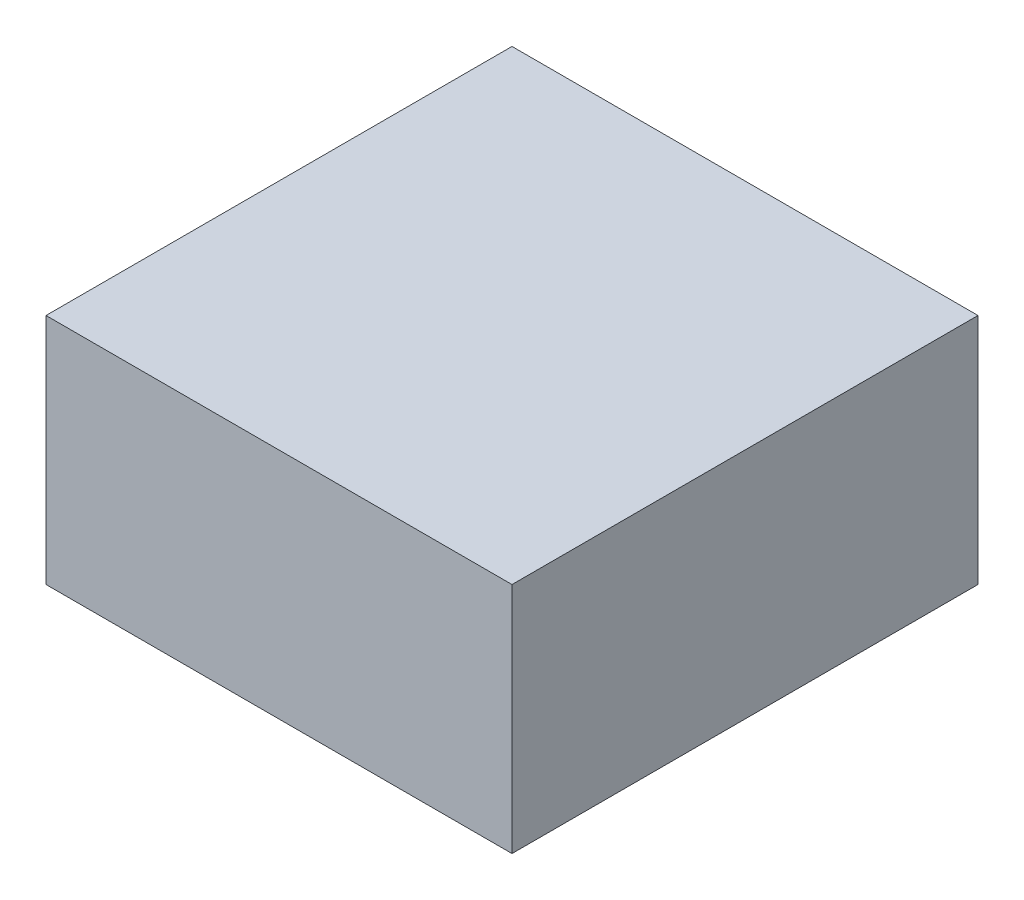
ISO-10303-21;
HEADER;
FILE_DESCRIPTION(('STEP AP214'),'2;1');
FILE_NAME('part.step','',(''),(''),'','','');
FILE_SCHEMA(('AUTOMOTIVE_DESIGN { 1 0 10303 214 1 1 1 1 }'));
ENDSEC;
DATA;
#1=APPLICATION_CONTEXT('core data for automotive mechanical design processes');
#2=APPLICATION_PROTOCOL_DEFINITION('international standard','automotive_design',2000,#1);
#3=PRODUCT_CONTEXT('',#1,'mechanical');
#4=PRODUCT('Part','Part','',(#3));
#5=PRODUCT_RELATED_PRODUCT_CATEGORY('part','',(#4));
#6=PRODUCT_DEFINITION_FORMATION('','',#4);
#7=PRODUCT_DEFINITION_CONTEXT('part definition',#1,'design');
#8=PRODUCT_DEFINITION('design','',#6,#7);
#9=PRODUCT_DEFINITION_SHAPE('','',#8);
#10=(LENGTH_UNIT() NAMED_UNIT(*) SI_UNIT(.MILLI.,.METRE.));
#11=(NAMED_UNIT(*) PLANE_ANGLE_UNIT() SI_UNIT($,.RADIAN.));
#12=(NAMED_UNIT(*) SI_UNIT($,.STERADIAN.) SOLID_ANGLE_UNIT());
#13=UNCERTAINTY_MEASURE_WITH_UNIT(LENGTH_MEASURE(1.E-05),#10,'distance_accuracy_value','');
#14=(GEOMETRIC_REPRESENTATION_CONTEXT(3) GLOBAL_UNCERTAINTY_ASSIGNED_CONTEXT((#13)) GLOBAL_UNIT_ASSIGNED_CONTEXT((#10,
#11,#12)) REPRESENTATION_CONTEXT('',''));
#15=CARTESIAN_POINT('',(0.,0.,0.));
#16=DIRECTION('',(0.,0.,1.));
#17=DIRECTION('',(1.,0.,0.));
#18=AXIS2_PLACEMENT_3D('',#15,#16,#17);
#19=CARTESIAN_POINT('',(25.,25.,25.));
#20=DIRECTION('',(-1.,0.,0.));
#21=DIRECTION('',(0.,0.,1.));
#22=AXIS2_PLACEMENT_3D('',#19,#20,#21);
#23=PLANE('',#22);
#24=DIRECTION('',(0.,0.,-1.));
#25=VECTOR('',#24,1.);
#26=CARTESIAN_POINT('',(25.,0.,25.));
#27=LINE('',#26,#25);
#28=CARTESIAN_POINT('',(25.,0.,25.));
#29=VERTEX_POINT('',#28);
#30=CARTESIAN_POINT('',(25.,0.,-25.));
#31=VERTEX_POINT('',#30);
#32=EDGE_CURVE('E98',#29,#31,#27,.T.);
#33=ORIENTED_EDGE('',*,*,#32,.T.);
#34=DIRECTION('',(0.,-1.,0.));
#35=VECTOR('',#34,1.);
#36=CARTESIAN_POINT('',(25.,25.,-25.));
#37=LINE('',#36,#35);
#38=CARTESIAN_POINT('',(25.,25.,-25.));
#39=VERTEX_POINT('',#38);
#40=EDGE_CURVE('E11',#39,#31,#37,.T.);
#41=ORIENTED_EDGE('',*,*,#40,.F.);
#42=DIRECTION('',(0.,0.,-1.));
#43=VECTOR('',#42,1.);
#44=CARTESIAN_POINT('',(25.,25.,25.));
#45=LINE('',#44,#43);
#46=CARTESIAN_POINT('',(25.,25.,25.));
#47=VERTEX_POINT('',#46);
#48=EDGE_CURVE('E86',#47,#39,#45,.T.);
#49=ORIENTED_EDGE('',*,*,#48,.F.);
#50=DIRECTION('',(0.,-1.,0.));
#51=VECTOR('',#50,1.);
#52=CARTESIAN_POINT('',(25.,25.,25.));
#53=LINE('',#52,#51);
#54=EDGE_CURVE('E94',#47,#29,#53,.T.);
#55=ORIENTED_EDGE('',*,*,#54,.T.);
#56=EDGE_LOOP('',(#33,#41,#49,#55));
#57=FACE_BOUND('',#56,.T.);
#58=ADVANCED_FACE('F35',(#57),#23,.F.);
#59=CARTESIAN_POINT('',(-25.,25.,-25.));
#60=DIRECTION('',(0.,0.,1.));
#61=DIRECTION('',(1.,0.,0.));
#62=AXIS2_PLACEMENT_3D('',#59,#60,#61);
#63=PLANE('',#62);
#64=DIRECTION('',(-1.,0.,0.));
#65=VECTOR('',#64,1.);
#66=CARTESIAN_POINT('',(-25.,0.,-25.));
#67=LINE('',#66,#65);
#68=CARTESIAN_POINT('',(-25.,0.,-25.));
#69=VERTEX_POINT('',#68);
#70=EDGE_CURVE('E90',#31,#69,#67,.T.);
#71=ORIENTED_EDGE('',*,*,#70,.T.);
#72=DIRECTION('',(0.,-1.,0.));
#73=VECTOR('',#72,1.);
#74=CARTESIAN_POINT('',(-25.,25.,-25.));
#75=LINE('',#74,#73);
#76=CARTESIAN_POINT('',(-25.,25.,-25.));
#77=VERTEX_POINT('',#76);
#78=EDGE_CURVE('E43',#77,#69,#75,.T.);
#79=ORIENTED_EDGE('',*,*,#78,.F.);
#80=DIRECTION('',(-1.,0.,0.));
#81=VECTOR('',#80,1.);
#82=CARTESIAN_POINT('',(-25.,25.,-25.));
#83=LINE('',#82,#81);
#84=EDGE_CURVE('E81',#39,#77,#83,.T.);
#85=ORIENTED_EDGE('',*,*,#84,.F.);
#86=ORIENTED_EDGE('',*,*,#40,.T.);
#87=EDGE_LOOP('',(#71,#79,#85,#86));
#88=FACE_BOUND('',#87,.T.);
#89=ADVANCED_FACE('F89',(#88),#63,.F.);
#90=CARTESIAN_POINT('',(-25.,25.,25.));
#91=DIRECTION('',(1.,0.,0.));
#92=DIRECTION('',(0.,0.,-1.));
#93=AXIS2_PLACEMENT_3D('',#90,#91,#92);
#94=PLANE('',#93);
#95=DIRECTION('',(0.,0.,1.));
#96=VECTOR('',#95,1.);
#97=CARTESIAN_POINT('',(-25.,0.,25.));
#98=LINE('',#97,#96);
#99=CARTESIAN_POINT('',(-25.,0.,25.));
#100=VERTEX_POINT('',#99);
#101=EDGE_CURVE('E68',#69,#100,#98,.T.);
#102=ORIENTED_EDGE('',*,*,#101,.T.);
#103=DIRECTION('',(0.,-1.,0.));
#104=VECTOR('',#103,1.);
#105=CARTESIAN_POINT('',(-25.,25.,25.));
#106=LINE('',#105,#104);
#107=CARTESIAN_POINT('',(-25.,25.,25.));
#108=VERTEX_POINT('',#107);
#109=EDGE_CURVE('E91',#108,#100,#106,.T.);
#110=ORIENTED_EDGE('',*,*,#109,.F.);
#111=DIRECTION('',(0.,0.,1.));
#112=VECTOR('',#111,1.);
#113=CARTESIAN_POINT('',(-25.,25.,25.));
#114=LINE('',#113,#112);
#115=EDGE_CURVE('E84',#77,#108,#114,.T.);
#116=ORIENTED_EDGE('',*,*,#115,.F.);
#117=ORIENTED_EDGE('',*,*,#78,.T.);
#118=EDGE_LOOP('',(#102,#110,#116,#117));
#119=FACE_BOUND('',#118,.T.);
#120=ADVANCED_FACE('F92',(#119),#94,.F.);
#121=CARTESIAN_POINT('',(-25.,25.,25.));
#122=DIRECTION('',(0.,0.,-1.));
#123=DIRECTION('',(-1.,0.,0.));
#124=AXIS2_PLACEMENT_3D('',#121,#122,#123);
#125=PLANE('',#124);
#126=DIRECTION('',(1.,0.,0.));
#127=VECTOR('',#126,1.);
#128=CARTESIAN_POINT('',(-25.,0.,25.));
#129=LINE('',#128,#127);
#130=EDGE_CURVE('E74',#100,#29,#129,.T.);
#131=ORIENTED_EDGE('',*,*,#130,.T.);
#132=ORIENTED_EDGE('',*,*,#54,.F.);
#133=DIRECTION('',(1.,0.,0.));
#134=VECTOR('',#133,1.);
#135=CARTESIAN_POINT('',(-25.,25.,25.));
#136=LINE('',#135,#134);
#137=EDGE_CURVE('E51',#108,#47,#136,.T.);
#138=ORIENTED_EDGE('',*,*,#137,.F.);
#139=ORIENTED_EDGE('',*,*,#109,.T.);
#140=EDGE_LOOP('',(#131,#132,#138,#139));
#141=FACE_BOUND('',#140,.T.);
#142=ADVANCED_FACE('F105',(#141),#125,.F.);
#143=CARTESIAN_POINT('',(0.,25.,0.));
#144=DIRECTION('',(0.,-1.,0.));
#145=DIRECTION('',(0.,0.,-1.));
#146=AXIS2_PLACEMENT_3D('',#143,#144,#145);
#147=PLANE('',#146);
#148=ORIENTED_EDGE('',*,*,#48,.T.);
#149=ORIENTED_EDGE('',*,*,#84,.T.);
#150=ORIENTED_EDGE('',*,*,#115,.T.);
#151=ORIENTED_EDGE('',*,*,#137,.T.);
#152=EDGE_LOOP('',(#148,#149,#150,#151));
#153=FACE_BOUND('',#152,.T.);
#154=ADVANCED_FACE('F82',(#153),#147,.F.);
#155=CARTESIAN_POINT('',(0.,0.,0.));
#156=DIRECTION('',(0.,-1.,0.));
#157=DIRECTION('',(0.,0.,-1.));
#158=AXIS2_PLACEMENT_3D('',#155,#156,#157);
#159=PLANE('',#158);
#160=ORIENTED_EDGE('',*,*,#32,.F.);
#161=ORIENTED_EDGE('',*,*,#130,.F.);
#162=ORIENTED_EDGE('',*,*,#101,.F.);
#163=ORIENTED_EDGE('',*,*,#70,.F.);
#164=EDGE_LOOP('',(#160,#161,#162,#163));
#165=FACE_BOUND('',#164,.T.);
#166=ADVANCED_FACE('F108',(#165),#159,.T.);
#167=CLOSED_SHELL('',(#58,#89,#120,#142,#154,#166));
#168=MANIFOLD_SOLID_BREP('B2',#167);
#169=ADVANCED_BREP_SHAPE_REPRESENTATION('',(#18,#168),#14);
#170=SHAPE_DEFINITION_REPRESENTATION(#9,#169);
ENDSEC;
END-ISO-10303-21;
